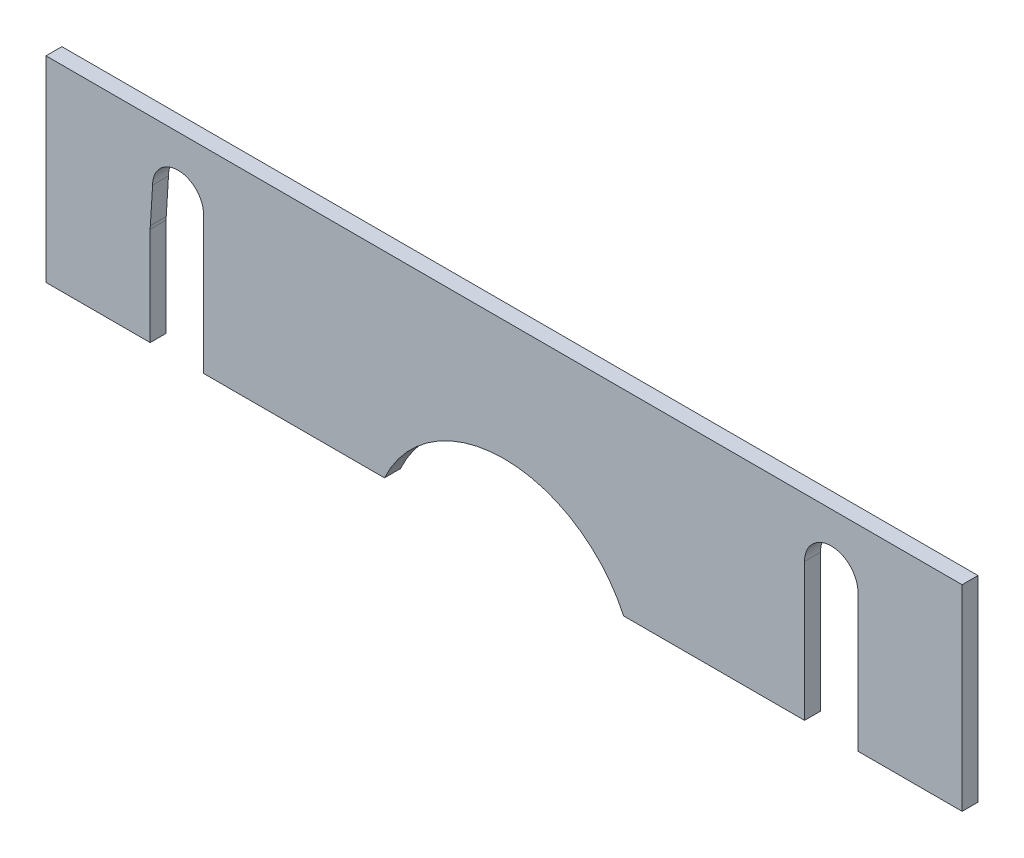
ISO-10303-21;
HEADER;
FILE_DESCRIPTION(('STEP AP214'),'2;1');
FILE_NAME('part.step','',(''),(''),'','','');
FILE_SCHEMA(('AUTOMOTIVE_DESIGN { 1 0 10303 214 1 1 1 1 }'));
ENDSEC;
DATA;
#1=APPLICATION_CONTEXT('core data for automotive mechanical design processes');
#2=APPLICATION_PROTOCOL_DEFINITION('international standard','automotive_design',2000,#1);
#3=PRODUCT_CONTEXT('',#1,'mechanical');
#4=PRODUCT('Part','Part','',(#3));
#5=PRODUCT_RELATED_PRODUCT_CATEGORY('part','',(#4));
#6=PRODUCT_DEFINITION_FORMATION('','',#4);
#7=PRODUCT_DEFINITION_CONTEXT('part definition',#1,'design');
#8=PRODUCT_DEFINITION('design','',#6,#7);
#9=PRODUCT_DEFINITION_SHAPE('','',#8);
#10=(LENGTH_UNIT() NAMED_UNIT(*) SI_UNIT(.MILLI.,.METRE.));
#11=(NAMED_UNIT(*) PLANE_ANGLE_UNIT() SI_UNIT($,.RADIAN.));
#12=(NAMED_UNIT(*) SI_UNIT($,.STERADIAN.) SOLID_ANGLE_UNIT());
#13=UNCERTAINTY_MEASURE_WITH_UNIT(LENGTH_MEASURE(1.E-05),#10,'distance_accuracy_value','');
#14=(GEOMETRIC_REPRESENTATION_CONTEXT(3) GLOBAL_UNCERTAINTY_ASSIGNED_CONTEXT((#13)) GLOBAL_UNIT_ASSIGNED_CONTEXT((#10,
#11,#12)) REPRESENTATION_CONTEXT('',''));
#15=CARTESIAN_POINT('',(0.,0.,0.));
#16=DIRECTION('',(0.,0.,1.));
#17=DIRECTION('',(1.,0.,0.));
#18=AXIS2_PLACEMENT_3D('',#15,#16,#17);
#19=CARTESIAN_POINT('',(0.,0.,-1.21412));
#20=DIRECTION('',(0.,0.,1.));
#21=DIRECTION('',(1.,0.,0.));
#22=AXIS2_PLACEMENT_3D('',#19,#20,#21);
#23=PLANE('',#22);
#24=DIRECTION('',(0.,1.,0.));
#25=VECTOR('',#24,1.);
#26=CARTESIAN_POINT('',(-22.96,0.,-1.21412));
#27=LINE('',#26,#25);
#28=CARTESIAN_POINT('',(-22.96,-7.5,-1.21412));
#29=VERTEX_POINT('',#28);
#30=CARTESIAN_POINT('',(-22.96,3.02223410102265,-1.21412));
#31=VERTEX_POINT('',#30);
#32=EDGE_CURVE('E214',#29,#31,#27,.T.);
#33=ORIENTED_EDGE('',*,*,#32,.T.);
#34=CARTESIAN_POINT('',(-24.9073984968454,3.02223410102265,-1.21412));
#35=DIRECTION('',(0.,0.,1.));
#36=DIRECTION('',(1.,0.,0.));
#37=AXIS2_PLACEMENT_3D('',#34,#35,#36);
#38=CIRCLE('',#37,1.94739849684544);
#39=CARTESIAN_POINT('',(-26.8547969936909,3.02223410102265,-1.21412));
#40=VERTEX_POINT('',#39);
#41=EDGE_CURVE('E174',#31,#40,#38,.T.);
#42=ORIENTED_EDGE('',*,*,#41,.T.);
#43=DIRECTION('',(-0.0611654272542421,-0.998127642392899,0.));
#44=VECTOR('',#43,1.);
#45=CARTESIAN_POINT('',(-26.9388376953581,1.65081643608129,-1.21412));
#46=LINE('',#45,#44);
#47=CARTESIAN_POINT('',(-27.0247358652759,0.249087687101039,-1.21412));
#48=VERTEX_POINT('',#47);
#49=EDGE_CURVE('E181',#40,#48,#46,.T.);
#50=ORIENTED_EDGE('',*,*,#49,.T.);
#51=CARTESIAN_POINT('',(-25.,0.,-1.21412));
#52=DIRECTION('',(0.,0.,1.));
#53=DIRECTION('',(1.,0.,0.));
#54=AXIS2_PLACEMENT_3D('',#51,#52,#53);
#55=CIRCLE('',#54,2.04);
#56=CARTESIAN_POINT('',(-27.04,0.,-1.21412));
#57=VERTEX_POINT('',#56);
#58=EDGE_CURVE('E54',#48,#57,#55,.T.);
#59=ORIENTED_EDGE('',*,*,#58,.T.);
#60=DIRECTION('',(0.,1.,0.));
#61=VECTOR('',#60,1.);
#62=CARTESIAN_POINT('',(-27.04,0.,-1.21412));
#63=LINE('',#62,#61);
#64=CARTESIAN_POINT('',(-27.04,-7.5,-1.21412));
#65=VERTEX_POINT('',#64);
#66=EDGE_CURVE('E164',#57,#65,#63,.F.);
#67=ORIENTED_EDGE('',*,*,#66,.T.);
#68=DIRECTION('',(1.,0.,0.));
#69=VECTOR('',#68,1.);
#70=CARTESIAN_POINT('',(-35.,-7.5,-1.21412));
#71=LINE('',#70,#69);
#72=CARTESIAN_POINT('',(-35.,-7.5,-1.21412));
#73=VERTEX_POINT('',#72);
#74=EDGE_CURVE('E248',#73,#65,#71,.T.);
#75=ORIENTED_EDGE('',*,*,#74,.F.);
#76=DIRECTION('',(0.,-1.,0.));
#77=VECTOR('',#76,1.);
#78=CARTESIAN_POINT('',(-35.,7.5,-1.21412));
#79=LINE('',#78,#77);
#80=CARTESIAN_POINT('',(-35.,7.5,-1.21412));
#81=VERTEX_POINT('',#80);
#82=EDGE_CURVE('E244',#81,#73,#79,.T.);
#83=ORIENTED_EDGE('',*,*,#82,.F.);
#84=DIRECTION('',(-1.,0.,0.));
#85=VECTOR('',#84,1.);
#86=CARTESIAN_POINT('',(-35.,7.5,-1.21412));
#87=LINE('',#86,#85);
#88=CARTESIAN_POINT('',(35.,7.5,-1.21412));
#89=VERTEX_POINT('',#88);
#90=EDGE_CURVE('E240',#89,#81,#87,.T.);
#91=ORIENTED_EDGE('',*,*,#90,.F.);
#92=DIRECTION('',(0.,1.,0.));
#93=VECTOR('',#92,1.);
#94=CARTESIAN_POINT('',(35.,7.5,-1.21412));
#95=LINE('',#94,#93);
#96=CARTESIAN_POINT('',(35.,-7.5,-1.21412));
#97=VERTEX_POINT('',#96);
#98=EDGE_CURVE('E237',#97,#89,#95,.T.);
#99=ORIENTED_EDGE('',*,*,#98,.F.);
#100=CARTESIAN_POINT('',(27.04,-7.5,-1.21412));
#101=VERTEX_POINT('',#100);
#102=EDGE_CURVE('E247',#101,#97,#71,.T.);
#103=ORIENTED_EDGE('',*,*,#102,.F.);
#104=DIRECTION('',(0.,1.,0.));
#105=VECTOR('',#104,1.);
#106=CARTESIAN_POINT('',(27.04,0.,-1.21412));
#107=LINE('',#106,#105);
#108=CARTESIAN_POINT('',(27.04,3.02223410102265,-1.21412));
#109=VERTEX_POINT('',#108);
#110=EDGE_CURVE('E200',#101,#109,#107,.T.);
#111=ORIENTED_EDGE('',*,*,#110,.T.);
#112=CARTESIAN_POINT('',(25.,3.02223410102265,-1.21412));
#113=DIRECTION('',(0.,0.,1.));
#114=DIRECTION('',(1.,0.,0.));
#115=AXIS2_PLACEMENT_3D('',#112,#113,#114);
#116=CIRCLE('',#115,2.04);
#117=CARTESIAN_POINT('',(22.96,3.02223410102265,-1.21412));
#118=VERTEX_POINT('',#117);
#119=EDGE_CURVE('E195',#109,#118,#116,.T.);
#120=ORIENTED_EDGE('',*,*,#119,.T.);
#121=DIRECTION('',(0.,1.,0.));
#122=VECTOR('',#121,1.);
#123=CARTESIAN_POINT('',(22.96,0.,-1.21412));
#124=LINE('',#123,#122);
#125=CARTESIAN_POINT('',(22.96,-7.5,-1.21412));
#126=VERTEX_POINT('',#125);
#127=EDGE_CURVE('E198',#118,#126,#124,.F.);
#128=ORIENTED_EDGE('',*,*,#127,.T.);
#129=CARTESIAN_POINT('',(9.13692937196815,-7.5,-1.21412));
#130=VERTEX_POINT('',#129);
#131=EDGE_CURVE('E252',#130,#126,#71,.T.);
#132=ORIENTED_EDGE('',*,*,#131,.F.);
#133=CARTESIAN_POINT('',(0.,-11.7283949166009,-1.21412));
#134=DIRECTION('',(0.,0.,1.));
#135=DIRECTION('',(1.,0.,0.));
#136=AXIS2_PLACEMENT_3D('',#133,#134,#135);
#137=CIRCLE('',#136,10.0679095108702);
#138=CARTESIAN_POINT('',(-9.13692937196818,-7.5,-1.21412));
#139=VERTEX_POINT('',#138);
#140=EDGE_CURVE('E222',#130,#139,#137,.T.);
#141=ORIENTED_EDGE('',*,*,#140,.T.);
#142=EDGE_CURVE('E251',#29,#139,#71,.T.);
#143=ORIENTED_EDGE('',*,*,#142,.F.);
#144=EDGE_LOOP('',(#33,#42,#50,#59,#67,#75,#83,#91,#99,#103,#111,#120,#128,#132,#141,#143));
#145=FACE_BOUND('',#144,.T.);
#146=ADVANCED_FACE('F37',(#145),#23,.F.);
#147=CARTESIAN_POINT('',(0.,0.,0.));
#148=DIRECTION('',(0.,0.,1.));
#149=DIRECTION('',(1.,0.,0.));
#150=AXIS2_PLACEMENT_3D('',#147,#148,#149);
#151=PLANE('',#150);
#152=CARTESIAN_POINT('',(-24.9073984968454,3.02223410102265,0.));
#153=DIRECTION('',(0.,0.,1.));
#154=DIRECTION('',(1.,0.,0.));
#155=AXIS2_PLACEMENT_3D('',#152,#153,#154);
#156=CIRCLE('',#155,1.94739849684544);
#157=CARTESIAN_POINT('',(-22.96,3.02223410102265,0.));
#158=VERTEX_POINT('',#157);
#159=CARTESIAN_POINT('',(-26.8547969936909,3.02223410102265,0.));
#160=VERTEX_POINT('',#159);
#161=EDGE_CURVE('E171',#158,#160,#156,.T.);
#162=ORIENTED_EDGE('',*,*,#161,.F.);
#163=DIRECTION('',(0.,1.,0.));
#164=VECTOR('',#163,1.);
#165=CARTESIAN_POINT('',(-22.96,0.,0.));
#166=LINE('',#165,#164);
#167=CARTESIAN_POINT('',(-22.96,-7.5,0.));
#168=VERTEX_POINT('',#167);
#169=EDGE_CURVE('E155',#168,#158,#166,.T.);
#170=ORIENTED_EDGE('',*,*,#169,.F.);
#171=DIRECTION('',(1.,0.,0.));
#172=VECTOR('',#171,1.);
#173=CARTESIAN_POINT('',(-35.,-7.5,0.));
#174=LINE('',#173,#172);
#175=CARTESIAN_POINT('',(-9.13692937196818,-7.5,0.));
#176=VERTEX_POINT('',#175);
#177=EDGE_CURVE('E263',#168,#176,#174,.T.);
#178=ORIENTED_EDGE('',*,*,#177,.T.);
#179=CARTESIAN_POINT('',(0.,-11.7283949166009,0.));
#180=DIRECTION('',(0.,0.,1.));
#181=DIRECTION('',(1.,0.,0.));
#182=AXIS2_PLACEMENT_3D('',#179,#180,#181);
#183=CIRCLE('',#182,10.0679095108702);
#184=CARTESIAN_POINT('',(9.13692937196815,-7.5,0.));
#185=VERTEX_POINT('',#184);
#186=EDGE_CURVE('E225',#185,#176,#183,.T.);
#187=ORIENTED_EDGE('',*,*,#186,.F.);
#188=CARTESIAN_POINT('',(22.96,-7.5,0.));
#189=VERTEX_POINT('',#188);
#190=EDGE_CURVE('E264',#185,#189,#174,.T.);
#191=ORIENTED_EDGE('',*,*,#190,.T.);
#192=DIRECTION('',(0.,-1.,0.));
#193=VECTOR('',#192,1.);
#194=CARTESIAN_POINT('',(22.96,0.,0.));
#195=LINE('',#194,#193);
#196=CARTESIAN_POINT('',(22.96,3.02223410102265,0.));
#197=VERTEX_POINT('',#196);
#198=EDGE_CURVE('E206',#197,#189,#195,.T.);
#199=ORIENTED_EDGE('',*,*,#198,.F.);
#200=CARTESIAN_POINT('',(25.,3.02223410102265,0.));
#201=DIRECTION('',(0.,0.,1.));
#202=DIRECTION('',(1.,0.,0.));
#203=AXIS2_PLACEMENT_3D('',#200,#201,#202);
#204=CIRCLE('',#203,2.04);
#205=CARTESIAN_POINT('',(27.04,3.02223410102265,0.));
#206=VERTEX_POINT('',#205);
#207=EDGE_CURVE('E194',#206,#197,#204,.T.);
#208=ORIENTED_EDGE('',*,*,#207,.F.);
#209=DIRECTION('',(0.,1.,0.));
#210=VECTOR('',#209,1.);
#211=CARTESIAN_POINT('',(27.04,0.,0.));
#212=LINE('',#211,#210);
#213=CARTESIAN_POINT('',(27.04,-7.5,0.));
#214=VERTEX_POINT('',#213);
#215=EDGE_CURVE('E199',#214,#206,#212,.T.);
#216=ORIENTED_EDGE('',*,*,#215,.F.);
#217=CARTESIAN_POINT('',(35.,-7.5,0.));
#218=VERTEX_POINT('',#217);
#219=EDGE_CURVE('E261',#214,#218,#174,.T.);
#220=ORIENTED_EDGE('',*,*,#219,.T.);
#221=DIRECTION('',(0.,1.,0.));
#222=VECTOR('',#221,1.);
#223=CARTESIAN_POINT('',(35.,7.5,0.));
#224=LINE('',#223,#222);
#225=CARTESIAN_POINT('',(35.,7.5,0.));
#226=VERTEX_POINT('',#225);
#227=EDGE_CURVE('E235',#218,#226,#224,.T.);
#228=ORIENTED_EDGE('',*,*,#227,.T.);
#229=DIRECTION('',(-1.,0.,0.));
#230=VECTOR('',#229,1.);
#231=CARTESIAN_POINT('',(-35.,7.5,0.));
#232=LINE('',#231,#230);
#233=CARTESIAN_POINT('',(-35.,7.5,0.));
#234=VERTEX_POINT('',#233);
#235=EDGE_CURVE('E255',#226,#234,#232,.T.);
#236=ORIENTED_EDGE('',*,*,#235,.T.);
#237=DIRECTION('',(0.,-1.,0.));
#238=VECTOR('',#237,1.);
#239=CARTESIAN_POINT('',(-35.,7.5,0.));
#240=LINE('',#239,#238);
#241=CARTESIAN_POINT('',(-35.,-7.5,0.));
#242=VERTEX_POINT('',#241);
#243=EDGE_CURVE('E258',#234,#242,#240,.T.);
#244=ORIENTED_EDGE('',*,*,#243,.T.);
#245=CARTESIAN_POINT('',(-27.04,-7.5,0.));
#246=VERTEX_POINT('',#245);
#247=EDGE_CURVE('E241',#242,#246,#174,.T.);
#248=ORIENTED_EDGE('',*,*,#247,.T.);
#249=DIRECTION('',(0.,-1.,0.));
#250=VECTOR('',#249,1.);
#251=CARTESIAN_POINT('',(-27.04,0.,0.));
#252=LINE('',#251,#250);
#253=CARTESIAN_POINT('',(-27.04,0.,0.));
#254=VERTEX_POINT('',#253);
#255=EDGE_CURVE('E165',#254,#246,#252,.T.);
#256=ORIENTED_EDGE('',*,*,#255,.F.);
#257=CARTESIAN_POINT('',(-25.,0.,0.));
#258=DIRECTION('',(0.,0.,1.));
#259=DIRECTION('',(1.,0.,0.));
#260=AXIS2_PLACEMENT_3D('',#257,#258,#259);
#261=CIRCLE('',#260,2.04);
#262=CARTESIAN_POINT('',(-27.0247358652759,0.249087687101039,0.));
#263=VERTEX_POINT('',#262);
#264=EDGE_CURVE('E232',#263,#254,#261,.T.);
#265=ORIENTED_EDGE('',*,*,#264,.F.);
#266=DIRECTION('',(-0.0611654272542421,-0.998127642392899,0.));
#267=VECTOR('',#266,1.);
#268=CARTESIAN_POINT('',(-26.9388376953581,1.65081643608129,0.));
#269=LINE('',#268,#267);
#270=EDGE_CURVE('E180',#160,#263,#269,.T.);
#271=ORIENTED_EDGE('',*,*,#270,.F.);
#272=EDGE_LOOP('',(#162,#170,#178,#187,#191,#199,#208,#216,#220,#228,#236,#244,#248,#256,#265,#271));
#273=FACE_BOUND('',#272,.T.);
#274=ADVANCED_FACE('F178',(#273),#151,.T.);
#275=CARTESIAN_POINT('',(-25.,0.,-1.21412));
#276=DIRECTION('',(0.,0.,1.));
#277=DIRECTION('',(1.,0.,0.));
#278=AXIS2_PLACEMENT_3D('',#275,#276,#277);
#279=CYLINDRICAL_SURFACE('',#278,2.04);
#280=DIRECTION('',(0.,0.,1.));
#281=VECTOR('',#280,1.);
#282=CARTESIAN_POINT('',(-27.0247358652759,0.249087687101039,0.));
#283=LINE('',#282,#281);
#284=EDGE_CURVE('E175',#263,#48,#283,.F.);
#285=ORIENTED_EDGE('',*,*,#284,.F.);
#286=ORIENTED_EDGE('',*,*,#264,.T.);
#287=DIRECTION('',(0.,0.,1.));
#288=VECTOR('',#287,1.);
#289=CARTESIAN_POINT('',(-27.04,0.,0.));
#290=LINE('',#289,#288);
#291=EDGE_CURVE('E216',#254,#57,#290,.F.);
#292=ORIENTED_EDGE('',*,*,#291,.T.);
#293=ORIENTED_EDGE('',*,*,#58,.F.);
#294=EDGE_LOOP('',(#285,#286,#292,#293));
#295=FACE_BOUND('',#294,.T.);
#296=ADVANCED_FACE('F296',(#295),#279,.F.);
#297=CARTESIAN_POINT('',(-35.,-7.5,-1.21412));
#298=DIRECTION('',(0.,-1.,0.));
#299=DIRECTION('',(0.,0.,-1.));
#300=AXIS2_PLACEMENT_3D('',#297,#298,#299);
#301=PLANE('',#300);
#302=ORIENTED_EDGE('',*,*,#219,.F.);
#303=DIRECTION('',(0.,0.,1.));
#304=VECTOR('',#303,1.);
#305=CARTESIAN_POINT('',(27.04,-7.5,0.));
#306=LINE('',#305,#304);
#307=EDGE_CURVE('E191',#214,#101,#306,.F.);
#308=ORIENTED_EDGE('',*,*,#307,.T.);
#309=ORIENTED_EDGE('',*,*,#102,.T.);
#310=DIRECTION('',(0.,0.,1.));
#311=VECTOR('',#310,1.);
#312=CARTESIAN_POINT('',(35.,-7.5,-1.21412));
#313=LINE('',#312,#311);
#314=EDGE_CURVE('E11',#97,#218,#313,.T.);
#315=ORIENTED_EDGE('',*,*,#314,.T.);
#316=EDGE_LOOP('',(#302,#308,#309,#315));
#317=FACE_BOUND('',#316,.T.);
#318=ADVANCED_FACE('F280',(#317),#301,.T.);
#319=ORIENTED_EDGE('',*,*,#131,.T.);
#320=DIRECTION('',(0.,0.,1.));
#321=VECTOR('',#320,1.);
#322=CARTESIAN_POINT('',(22.96,-7.5,0.));
#323=LINE('',#322,#321);
#324=EDGE_CURVE('E183',#189,#126,#323,.F.);
#325=ORIENTED_EDGE('',*,*,#324,.F.);
#326=ORIENTED_EDGE('',*,*,#190,.F.);
#327=DIRECTION('',(0.,0.,-1.));
#328=VECTOR('',#327,1.);
#329=CARTESIAN_POINT('',(9.13692937196815,-7.5,-1.21412));
#330=LINE('',#329,#328);
#331=EDGE_CURVE('E62',#130,#185,#330,.F.);
#332=ORIENTED_EDGE('',*,*,#331,.F.);
#333=EDGE_LOOP('',(#319,#325,#326,#332));
#334=FACE_BOUND('',#333,.T.);
#335=ADVANCED_FACE('F310',(#334),#301,.T.);
#336=ORIENTED_EDGE('',*,*,#177,.F.);
#337=DIRECTION('',(0.,0.,1.));
#338=VECTOR('',#337,1.);
#339=CARTESIAN_POINT('',(-22.96,-7.5,0.));
#340=LINE('',#339,#338);
#341=EDGE_CURVE('E160',#168,#29,#340,.F.);
#342=ORIENTED_EDGE('',*,*,#341,.T.);
#343=ORIENTED_EDGE('',*,*,#142,.T.);
#344=DIRECTION('',(0.,0.,-1.));
#345=VECTOR('',#344,1.);
#346=CARTESIAN_POINT('',(-9.13692937196818,-7.5,-1.21412));
#347=LINE('',#346,#345);
#348=EDGE_CURVE('E229',#139,#176,#347,.F.);
#349=ORIENTED_EDGE('',*,*,#348,.T.);
#350=EDGE_LOOP('',(#336,#342,#343,#349));
#351=FACE_BOUND('',#350,.T.);
#352=ADVANCED_FACE('F302',(#351),#301,.T.);
#353=ORIENTED_EDGE('',*,*,#74,.T.);
#354=DIRECTION('',(0.,0.,1.));
#355=VECTOR('',#354,1.);
#356=CARTESIAN_POINT('',(-27.04,-7.5,0.));
#357=LINE('',#356,#355);
#358=EDGE_CURVE('E220',#246,#65,#357,.F.);
#359=ORIENTED_EDGE('',*,*,#358,.F.);
#360=ORIENTED_EDGE('',*,*,#247,.F.);
#361=DIRECTION('',(0.,0.,1.));
#362=VECTOR('',#361,1.);
#363=CARTESIAN_POINT('',(-35.,-7.5,-1.21412));
#364=LINE('',#363,#362);
#365=EDGE_CURVE('E46',#73,#242,#364,.T.);
#366=ORIENTED_EDGE('',*,*,#365,.F.);
#367=EDGE_LOOP('',(#353,#359,#360,#366));
#368=FACE_BOUND('',#367,.T.);
#369=ADVANCED_FACE('F290',(#368),#301,.T.);
#370=CARTESIAN_POINT('',(35.,7.5,-1.21412));
#371=DIRECTION('',(1.,0.,0.));
#372=DIRECTION('',(0.,1.,0.));
#373=AXIS2_PLACEMENT_3D('',#370,#371,#372);
#374=PLANE('',#373);
#375=ORIENTED_EDGE('',*,*,#227,.F.);
#376=ORIENTED_EDGE('',*,*,#314,.F.);
#377=ORIENTED_EDGE('',*,*,#98,.T.);
#378=DIRECTION('',(0.,0.,1.));
#379=VECTOR('',#378,1.);
#380=CARTESIAN_POINT('',(35.,7.5,-1.21412));
#381=LINE('',#380,#379);
#382=EDGE_CURVE('E41',#89,#226,#381,.T.);
#383=ORIENTED_EDGE('',*,*,#382,.T.);
#384=EDGE_LOOP('',(#375,#376,#377,#383));
#385=FACE_BOUND('',#384,.T.);
#386=ADVANCED_FACE('F39',(#385),#374,.T.);
#387=CARTESIAN_POINT('',(-35.,7.5,-1.21412));
#388=DIRECTION('',(-1.,0.,0.));
#389=DIRECTION('',(0.,0.,1.));
#390=AXIS2_PLACEMENT_3D('',#387,#388,#389);
#391=PLANE('',#390);
#392=ORIENTED_EDGE('',*,*,#243,.F.);
#393=DIRECTION('',(0.,0.,1.));
#394=VECTOR('',#393,1.);
#395=CARTESIAN_POINT('',(-35.,7.5,-1.21412));
#396=LINE('',#395,#394);
#397=EDGE_CURVE('E266',#81,#234,#396,.T.);
#398=ORIENTED_EDGE('',*,*,#397,.F.);
#399=ORIENTED_EDGE('',*,*,#82,.T.);
#400=ORIENTED_EDGE('',*,*,#365,.T.);
#401=EDGE_LOOP('',(#392,#398,#399,#400));
#402=FACE_BOUND('',#401,.T.);
#403=ADVANCED_FACE('F285',(#402),#391,.T.);
#404=CARTESIAN_POINT('',(-35.,7.5,-1.21412));
#405=DIRECTION('',(0.,1.,0.));
#406=DIRECTION('',(0.,0.,1.));
#407=AXIS2_PLACEMENT_3D('',#404,#405,#406);
#408=PLANE('',#407);
#409=ORIENTED_EDGE('',*,*,#235,.F.);
#410=ORIENTED_EDGE('',*,*,#382,.F.);
#411=ORIENTED_EDGE('',*,*,#90,.T.);
#412=ORIENTED_EDGE('',*,*,#397,.T.);
#413=EDGE_LOOP('',(#409,#410,#411,#412));
#414=FACE_BOUND('',#413,.T.);
#415=ADVANCED_FACE('F275',(#414),#408,.T.);
#416=CARTESIAN_POINT('',(0.,-11.7283949166009,-1.21412));
#417=DIRECTION('',(0.,0.,1.));
#418=DIRECTION('',(1.,0.,0.));
#419=AXIS2_PLACEMENT_3D('',#416,#417,#418);
#420=CYLINDRICAL_SURFACE('',#419,10.0679095108702);
#421=ORIENTED_EDGE('',*,*,#348,.F.);
#422=ORIENTED_EDGE('',*,*,#140,.F.);
#423=ORIENTED_EDGE('',*,*,#331,.T.);
#424=ORIENTED_EDGE('',*,*,#186,.T.);
#425=EDGE_LOOP('',(#421,#422,#423,#424));
#426=FACE_BOUND('',#425,.T.);
#427=ADVANCED_FACE('F343',(#426),#420,.F.);
#428=CARTESIAN_POINT('',(-27.04,0.,0.));
#429=DIRECTION('',(-1.,0.,0.));
#430=DIRECTION('',(0.,-1.,0.));
#431=AXIS2_PLACEMENT_3D('',#428,#429,#430);
#432=PLANE('',#431);
#433=ORIENTED_EDGE('',*,*,#255,.T.);
#434=ORIENTED_EDGE('',*,*,#358,.T.);
#435=ORIENTED_EDGE('',*,*,#66,.F.);
#436=ORIENTED_EDGE('',*,*,#291,.F.);
#437=EDGE_LOOP('',(#433,#434,#435,#436));
#438=FACE_BOUND('',#437,.T.);
#439=ADVANCED_FACE('F292',(#438),#432,.F.);
#440=CARTESIAN_POINT('',(-22.96,0.,0.));
#441=DIRECTION('',(1.,0.,0.));
#442=DIRECTION('',(0.,1.,0.));
#443=AXIS2_PLACEMENT_3D('',#440,#441,#442);
#444=PLANE('',#443);
#445=ORIENTED_EDGE('',*,*,#341,.F.);
#446=ORIENTED_EDGE('',*,*,#169,.T.);
#447=DIRECTION('',(0.,0.,1.));
#448=VECTOR('',#447,1.);
#449=CARTESIAN_POINT('',(-22.96,3.02223410102265,0.));
#450=LINE('',#449,#448);
#451=EDGE_CURVE('E158',#158,#31,#450,.F.);
#452=ORIENTED_EDGE('',*,*,#451,.T.);
#453=ORIENTED_EDGE('',*,*,#32,.F.);
#454=EDGE_LOOP('',(#445,#446,#452,#453));
#455=FACE_BOUND('',#454,.T.);
#456=ADVANCED_FACE('F157',(#455),#444,.F.);
#457=CARTESIAN_POINT('',(27.04,0.,0.));
#458=DIRECTION('',(1.,0.,0.));
#459=DIRECTION('',(0.,1.,0.));
#460=AXIS2_PLACEMENT_3D('',#457,#458,#459);
#461=PLANE('',#460);
#462=ORIENTED_EDGE('',*,*,#110,.F.);
#463=ORIENTED_EDGE('',*,*,#307,.F.);
#464=ORIENTED_EDGE('',*,*,#215,.T.);
#465=DIRECTION('',(0.,0.,1.));
#466=VECTOR('',#465,1.);
#467=CARTESIAN_POINT('',(27.04,3.02223410102265,0.));
#468=LINE('',#467,#466);
#469=EDGE_CURVE('E209',#206,#109,#468,.F.);
#470=ORIENTED_EDGE('',*,*,#469,.T.);
#471=EDGE_LOOP('',(#462,#463,#464,#470));
#472=FACE_BOUND('',#471,.T.);
#473=ADVANCED_FACE('F319',(#472),#461,.F.);
#474=CARTESIAN_POINT('',(25.,3.02223410102265,0.));
#475=DIRECTION('',(0.,0.,1.));
#476=DIRECTION('',(1.,0.,0.));
#477=AXIS2_PLACEMENT_3D('',#474,#475,#476);
#478=CYLINDRICAL_SURFACE('',#477,2.04);
#479=ORIENTED_EDGE('',*,*,#469,.F.);
#480=ORIENTED_EDGE('',*,*,#207,.T.);
#481=DIRECTION('',(0.,0.,1.));
#482=VECTOR('',#481,1.);
#483=CARTESIAN_POINT('',(22.96,3.02223410102265,0.));
#484=LINE('',#483,#482);
#485=EDGE_CURVE('E203',#197,#118,#484,.F.);
#486=ORIENTED_EDGE('',*,*,#485,.T.);
#487=ORIENTED_EDGE('',*,*,#119,.F.);
#488=EDGE_LOOP('',(#479,#480,#486,#487));
#489=FACE_BOUND('',#488,.T.);
#490=ADVANCED_FACE('F317',(#489),#478,.F.);
#491=CARTESIAN_POINT('',(22.96,0.,0.));
#492=DIRECTION('',(-1.,0.,0.));
#493=DIRECTION('',(0.,-1.,0.));
#494=AXIS2_PLACEMENT_3D('',#491,#492,#493);
#495=PLANE('',#494);
#496=ORIENTED_EDGE('',*,*,#198,.T.);
#497=ORIENTED_EDGE('',*,*,#324,.T.);
#498=ORIENTED_EDGE('',*,*,#127,.F.);
#499=ORIENTED_EDGE('',*,*,#485,.F.);
#500=EDGE_LOOP('',(#496,#497,#498,#499));
#501=FACE_BOUND('',#500,.T.);
#502=ADVANCED_FACE('F313',(#501),#495,.F.);
#503=CARTESIAN_POINT('',(-24.9073984968454,3.02223410102265,0.));
#504=DIRECTION('',(0.,0.,1.));
#505=DIRECTION('',(1.,0.,0.));
#506=AXIS2_PLACEMENT_3D('',#503,#504,#505);
#507=CYLINDRICAL_SURFACE('',#506,1.94739849684544);
#508=ORIENTED_EDGE('',*,*,#451,.F.);
#509=ORIENTED_EDGE('',*,*,#161,.T.);
#510=DIRECTION('',(0.,0.,1.));
#511=VECTOR('',#510,1.);
#512=CARTESIAN_POINT('',(-26.8547969936909,3.02223410102265,0.));
#513=LINE('',#512,#511);
#514=EDGE_CURVE('E185',#160,#40,#513,.F.);
#515=ORIENTED_EDGE('',*,*,#514,.T.);
#516=ORIENTED_EDGE('',*,*,#41,.F.);
#517=EDGE_LOOP('',(#508,#509,#515,#516));
#518=FACE_BOUND('',#517,.T.);
#519=ADVANCED_FACE('F169',(#518),#507,.F.);
#520=CARTESIAN_POINT('',(-26.9388376953581,1.65081643608129,0.));
#521=DIRECTION('',(-0.998127642392899,0.0611654272542421,0.));
#522=DIRECTION('',(-0.0611654272542421,-0.998127642392899,0.));
#523=AXIS2_PLACEMENT_3D('',#520,#521,#522);
#524=PLANE('',#523);
#525=ORIENTED_EDGE('',*,*,#270,.T.);
#526=ORIENTED_EDGE('',*,*,#284,.T.);
#527=ORIENTED_EDGE('',*,*,#49,.F.);
#528=ORIENTED_EDGE('',*,*,#514,.F.);
#529=EDGE_LOOP('',(#525,#526,#527,#528));
#530=FACE_BOUND('',#529,.T.);
#531=ADVANCED_FACE('F355',(#530),#524,.F.);
#532=CLOSED_SHELL('',(#146,#274,#296,#318,#335,#352,#369,#386,#403,#415,#427,#439,#456,#473,
#490,#502,#519,#531));
#533=MANIFOLD_SOLID_BREP('B2',#532);
#534=ADVANCED_BREP_SHAPE_REPRESENTATION('',(#18,#533),#14);
#535=SHAPE_DEFINITION_REPRESENTATION(#9,#534);
ENDSEC;
END-ISO-10303-21;
